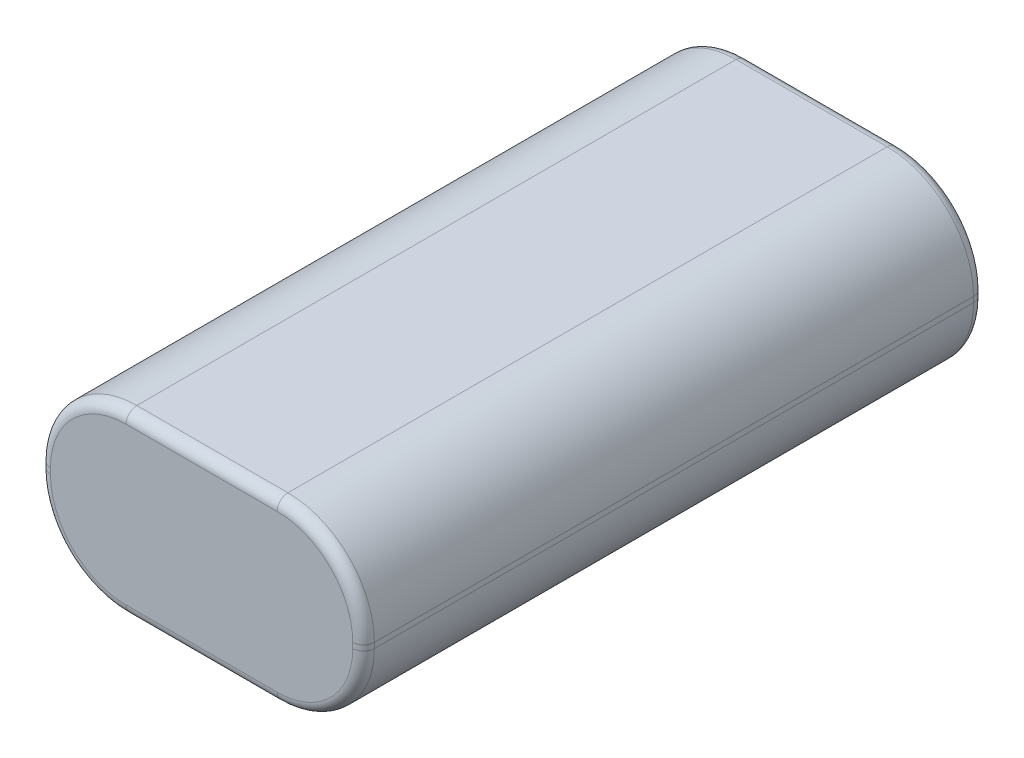
ISO-10303-21;
HEADER;
FILE_DESCRIPTION(('STEP AP214'),'2;1');
FILE_NAME('part.step','',(''),(''),'','','');
FILE_SCHEMA(('AUTOMOTIVE_DESIGN { 1 0 10303 214 1 1 1 1 }'));
ENDSEC;
DATA;
#1=APPLICATION_CONTEXT('core data for automotive mechanical design processes');
#2=APPLICATION_PROTOCOL_DEFINITION('international standard','automotive_design',2000,#1);
#3=PRODUCT_CONTEXT('',#1,'mechanical');
#4=PRODUCT('Part','Part','',(#3));
#5=PRODUCT_RELATED_PRODUCT_CATEGORY('part','',(#4));
#6=PRODUCT_DEFINITION_FORMATION('','',#4);
#7=PRODUCT_DEFINITION_CONTEXT('part definition',#1,'design');
#8=PRODUCT_DEFINITION('design','',#6,#7);
#9=PRODUCT_DEFINITION_SHAPE('','',#8);
#10=(LENGTH_UNIT() NAMED_UNIT(*) SI_UNIT(.MILLI.,.METRE.));
#11=(NAMED_UNIT(*) PLANE_ANGLE_UNIT() SI_UNIT($,.RADIAN.));
#12=(NAMED_UNIT(*) SI_UNIT($,.STERADIAN.) SOLID_ANGLE_UNIT());
#13=UNCERTAINTY_MEASURE_WITH_UNIT(LENGTH_MEASURE(1.E-05),#10,'distance_accuracy_value','');
#14=(GEOMETRIC_REPRESENTATION_CONTEXT(3) GLOBAL_UNCERTAINTY_ASSIGNED_CONTEXT((#13)) GLOBAL_UNIT_ASSIGNED_CONTEXT((#10,
#11,#12)) REPRESENTATION_CONTEXT('',''));
#15=CARTESIAN_POINT('',(0.,0.,0.));
#16=DIRECTION('',(0.,0.,1.));
#17=DIRECTION('',(1.,0.,0.));
#18=AXIS2_PLACEMENT_3D('',#15,#16,#17);
#19=CARTESIAN_POINT('',(8.,8.,57.5));
#20=DIRECTION('',(0.,0.,-1.));
#21=DIRECTION('',(-1.,0.,0.));
#22=AXIS2_PLACEMENT_3D('',#19,#20,#21);
#23=CYLINDRICAL_SURFACE('',#22,8.);
#24=DIRECTION('',(0.,0.,-1.));
#25=VECTOR('',#24,1.);
#26=CARTESIAN_POINT('',(0.,8.00000000000006,57.5));
#27=LINE('',#26,#25);
#28=CARTESIAN_POINT('',(0.,8.00000000000006,56.5));
#29=VERTEX_POINT('',#28);
#30=CARTESIAN_POINT('',(0.,8.00000000000006,1.));
#31=VERTEX_POINT('',#30);
#32=EDGE_CURVE('E347',#29,#31,#27,.T.);
#33=ORIENTED_EDGE('',*,*,#32,.T.);
#34=CARTESIAN_POINT('',(8.,8.,1.));
#35=DIRECTION('',(0.,0.,1.));
#36=DIRECTION('',(1.,0.,0.));
#37=AXIS2_PLACEMENT_3D('',#34,#35,#36);
#38=CIRCLE('',#37,8.);
#39=CARTESIAN_POINT('',(8.00000000000006,0.,1.));
#40=VERTEX_POINT('',#39);
#41=EDGE_CURVE('E296',#31,#40,#38,.T.);
#42=ORIENTED_EDGE('',*,*,#41,.T.);
#43=DIRECTION('',(0.,0.,-1.));
#44=VECTOR('',#43,1.);
#45=CARTESIAN_POINT('',(8.00000000000006,0.,57.5));
#46=LINE('',#45,#44);
#47=CARTESIAN_POINT('',(8.00000000000006,0.,56.5));
#48=VERTEX_POINT('',#47);
#49=EDGE_CURVE('E210',#48,#40,#46,.T.);
#50=ORIENTED_EDGE('',*,*,#49,.F.);
#51=CARTESIAN_POINT('',(8.,8.,56.5));
#52=DIRECTION('',(0.,0.,1.));
#53=DIRECTION('',(1.,0.,0.));
#54=AXIS2_PLACEMENT_3D('',#51,#52,#53);
#55=CIRCLE('',#54,8.);
#56=EDGE_CURVE('E293',#48,#29,#55,.F.);
#57=ORIENTED_EDGE('',*,*,#56,.T.);
#58=EDGE_LOOP('',(#33,#42,#50,#57));
#59=FACE_BOUND('',#58,.T.);
#60=ADVANCED_FACE('F41',(#59),#23,.T.);
#61=CARTESIAN_POINT('',(8.00000000000006,0.,57.5));
#62=DIRECTION('',(0.,1.,0.));
#63=DIRECTION('',(0.,0.,1.));
#64=AXIS2_PLACEMENT_3D('',#61,#62,#63);
#65=PLANE('',#64);
#66=ORIENTED_EDGE('',*,*,#49,.T.);
#67=DIRECTION('',(1.,0.,0.));
#68=VECTOR('',#67,1.);
#69=CARTESIAN_POINT('',(8.00000000000006,0.,1.));
#70=LINE('',#69,#68);
#71=CARTESIAN_POINT('',(21.9999999999999,0.,1.));
#72=VERTEX_POINT('',#71);
#73=EDGE_CURVE('E208',#40,#72,#70,.T.);
#74=ORIENTED_EDGE('',*,*,#73,.T.);
#75=DIRECTION('',(0.,0.,-1.));
#76=VECTOR('',#75,1.);
#77=CARTESIAN_POINT('',(21.9999999999999,0.,57.5));
#78=LINE('',#77,#76);
#79=CARTESIAN_POINT('',(21.9999999999999,0.,56.5));
#80=VERTEX_POINT('',#79);
#81=EDGE_CURVE('E189',#80,#72,#78,.T.);
#82=ORIENTED_EDGE('',*,*,#81,.F.);
#83=DIRECTION('',(1.,0.,0.));
#84=VECTOR('',#83,1.);
#85=CARTESIAN_POINT('',(8.00000000000006,0.,56.5));
#86=LINE('',#85,#84);
#87=EDGE_CURVE('E205',#80,#48,#86,.F.);
#88=ORIENTED_EDGE('',*,*,#87,.T.);
#89=EDGE_LOOP('',(#66,#74,#82,#88));
#90=FACE_BOUND('',#89,.T.);
#91=ADVANCED_FACE('F203',(#90),#65,.F.);
#92=CARTESIAN_POINT('',(22.,8.,57.5));
#93=DIRECTION('',(0.,0.,-1.));
#94=DIRECTION('',(-1.,0.,0.));
#95=AXIS2_PLACEMENT_3D('',#92,#93,#94);
#96=CYLINDRICAL_SURFACE('',#95,8.);
#97=ORIENTED_EDGE('',*,*,#81,.T.);
#98=CARTESIAN_POINT('',(22.,8.,1.));
#99=DIRECTION('',(0.,0.,1.));
#100=DIRECTION('',(1.,0.,0.));
#101=AXIS2_PLACEMENT_3D('',#98,#99,#100);
#102=CIRCLE('',#101,8.);
#103=CARTESIAN_POINT('',(30.,8.00000000000006,1.));
#104=VERTEX_POINT('',#103);
#105=EDGE_CURVE('E197',#72,#104,#102,.T.);
#106=ORIENTED_EDGE('',*,*,#105,.T.);
#107=DIRECTION('',(0.,0.,-1.));
#108=VECTOR('',#107,1.);
#109=CARTESIAN_POINT('',(30.,8.00000000000006,57.5));
#110=LINE('',#109,#108);
#111=CARTESIAN_POINT('',(30.,8.00000000000006,56.5));
#112=VERTEX_POINT('',#111);
#113=EDGE_CURVE('E191',#112,#104,#110,.T.);
#114=ORIENTED_EDGE('',*,*,#113,.F.);
#115=CARTESIAN_POINT('',(22.,8.,56.5));
#116=DIRECTION('',(0.,0.,1.));
#117=DIRECTION('',(1.,0.,0.));
#118=AXIS2_PLACEMENT_3D('',#115,#116,#117);
#119=CIRCLE('',#118,8.);
#120=EDGE_CURVE('E186',#112,#80,#119,.F.);
#121=ORIENTED_EDGE('',*,*,#120,.T.);
#122=EDGE_LOOP('',(#97,#106,#114,#121));
#123=FACE_BOUND('',#122,.T.);
#124=ADVANCED_FACE('F188',(#123),#96,.T.);
#125=CARTESIAN_POINT('',(30.,8.00000000000006,57.5));
#126=DIRECTION('',(-1.,0.,0.));
#127=DIRECTION('',(0.,0.,1.));
#128=AXIS2_PLACEMENT_3D('',#125,#126,#127);
#129=PLANE('',#128);
#130=ORIENTED_EDGE('',*,*,#113,.T.);
#131=DIRECTION('',(0.,1.,0.));
#132=VECTOR('',#131,1.);
#133=CARTESIAN_POINT('',(30.,8.00000000000006,1.));
#134=LINE('',#133,#132);
#135=CARTESIAN_POINT('',(30.,8.49999999999994,1.));
#136=VERTEX_POINT('',#135);
#137=EDGE_CURVE('E265',#104,#136,#134,.T.);
#138=ORIENTED_EDGE('',*,*,#137,.T.);
#139=DIRECTION('',(0.,0.,-1.));
#140=VECTOR('',#139,1.);
#141=CARTESIAN_POINT('',(30.,8.49999999999994,57.5));
#142=LINE('',#141,#140);
#143=CARTESIAN_POINT('',(30.,8.49999999999994,56.5));
#144=VERTEX_POINT('',#143);
#145=EDGE_CURVE('E377',#144,#136,#142,.T.);
#146=ORIENTED_EDGE('',*,*,#145,.F.);
#147=DIRECTION('',(0.,1.,0.));
#148=VECTOR('',#147,1.);
#149=CARTESIAN_POINT('',(30.,8.00000000000006,56.5));
#150=LINE('',#149,#148);
#151=EDGE_CURVE('E262',#144,#112,#150,.F.);
#152=ORIENTED_EDGE('',*,*,#151,.T.);
#153=EDGE_LOOP('',(#130,#138,#146,#152));
#154=FACE_BOUND('',#153,.T.);
#155=ADVANCED_FACE('F374',(#154),#129,.F.);
#156=CARTESIAN_POINT('',(22.,8.5,57.5));
#157=DIRECTION('',(0.,0.,-1.));
#158=DIRECTION('',(-1.,0.,0.));
#159=AXIS2_PLACEMENT_3D('',#156,#157,#158);
#160=CYLINDRICAL_SURFACE('',#159,8.);
#161=ORIENTED_EDGE('',*,*,#145,.T.);
#162=CARTESIAN_POINT('',(22.,8.5,1.));
#163=DIRECTION('',(0.,0.,1.));
#164=DIRECTION('',(1.,0.,0.));
#165=AXIS2_PLACEMENT_3D('',#162,#163,#164);
#166=CIRCLE('',#165,8.);
#167=CARTESIAN_POINT('',(21.9999999999999,16.5,1.));
#168=VERTEX_POINT('',#167);
#169=EDGE_CURVE('E271',#136,#168,#166,.T.);
#170=ORIENTED_EDGE('',*,*,#169,.T.);
#171=DIRECTION('',(0.,0.,-1.));
#172=VECTOR('',#171,1.);
#173=CARTESIAN_POINT('',(21.9999999999999,16.5,57.5));
#174=LINE('',#173,#172);
#175=CARTESIAN_POINT('',(21.9999999999999,16.5,56.5));
#176=VERTEX_POINT('',#175);
#177=EDGE_CURVE('E381',#176,#168,#174,.T.);
#178=ORIENTED_EDGE('',*,*,#177,.F.);
#179=CARTESIAN_POINT('',(22.,8.5,56.5));
#180=DIRECTION('',(0.,0.,1.));
#181=DIRECTION('',(1.,0.,0.));
#182=AXIS2_PLACEMENT_3D('',#179,#180,#181);
#183=CIRCLE('',#182,8.);
#184=EDGE_CURVE('E268',#176,#144,#183,.F.);
#185=ORIENTED_EDGE('',*,*,#184,.T.);
#186=EDGE_LOOP('',(#161,#170,#178,#185));
#187=FACE_BOUND('',#186,.T.);
#188=ADVANCED_FACE('F431',(#187),#160,.T.);
#189=CARTESIAN_POINT('',(8.00000000000006,16.5,57.5));
#190=DIRECTION('',(0.,-1.,0.));
#191=DIRECTION('',(0.,0.,-1.));
#192=AXIS2_PLACEMENT_3D('',#189,#190,#191);
#193=PLANE('',#192);
#194=ORIENTED_EDGE('',*,*,#177,.T.);
#195=DIRECTION('',(-1.,0.,0.));
#196=VECTOR('',#195,1.);
#197=CARTESIAN_POINT('',(8.00000000000006,16.5,1.));
#198=LINE('',#197,#196);
#199=CARTESIAN_POINT('',(8.00000000000006,16.5,1.));
#200=VERTEX_POINT('',#199);
#201=EDGE_CURVE('E277',#168,#200,#198,.T.);
#202=ORIENTED_EDGE('',*,*,#201,.T.);
#203=DIRECTION('',(0.,0.,-1.));
#204=VECTOR('',#203,1.);
#205=CARTESIAN_POINT('',(8.00000000000006,16.5,57.5));
#206=LINE('',#205,#204);
#207=CARTESIAN_POINT('',(8.00000000000006,16.5,56.5));
#208=VERTEX_POINT('',#207);
#209=EDGE_CURVE('E387',#208,#200,#206,.T.);
#210=ORIENTED_EDGE('',*,*,#209,.F.);
#211=DIRECTION('',(-1.,0.,0.));
#212=VECTOR('',#211,1.);
#213=CARTESIAN_POINT('',(21.9999999999999,16.5,56.5));
#214=LINE('',#213,#212);
#215=EDGE_CURVE('E274',#208,#176,#214,.F.);
#216=ORIENTED_EDGE('',*,*,#215,.T.);
#217=EDGE_LOOP('',(#194,#202,#210,#216));
#218=FACE_BOUND('',#217,.T.);
#219=ADVANCED_FACE('F434',(#218),#193,.F.);
#220=CARTESIAN_POINT('',(8.,8.5,57.5));
#221=DIRECTION('',(0.,0.,-1.));
#222=DIRECTION('',(-1.,0.,0.));
#223=AXIS2_PLACEMENT_3D('',#220,#221,#222);
#224=CYLINDRICAL_SURFACE('',#223,8.);
#225=ORIENTED_EDGE('',*,*,#209,.T.);
#226=CARTESIAN_POINT('',(8.,8.5,1.));
#227=DIRECTION('',(0.,0.,1.));
#228=DIRECTION('',(1.,0.,0.));
#229=AXIS2_PLACEMENT_3D('',#226,#227,#228);
#230=CIRCLE('',#229,8.);
#231=CARTESIAN_POINT('',(0.,8.49999999999994,1.));
#232=VERTEX_POINT('',#231);
#233=EDGE_CURVE('E283',#200,#232,#230,.T.);
#234=ORIENTED_EDGE('',*,*,#233,.T.);
#235=DIRECTION('',(0.,0.,-1.));
#236=VECTOR('',#235,1.);
#237=CARTESIAN_POINT('',(0.,8.49999999999994,57.5));
#238=LINE('',#237,#236);
#239=CARTESIAN_POINT('',(0.,8.49999999999994,56.5));
#240=VERTEX_POINT('',#239);
#241=EDGE_CURVE('E393',#240,#232,#238,.T.);
#242=ORIENTED_EDGE('',*,*,#241,.F.);
#243=CARTESIAN_POINT('',(8.,8.5,56.5));
#244=DIRECTION('',(0.,0.,1.));
#245=DIRECTION('',(1.,0.,0.));
#246=AXIS2_PLACEMENT_3D('',#243,#244,#245);
#247=CIRCLE('',#246,8.);
#248=EDGE_CURVE('E280',#240,#208,#247,.F.);
#249=ORIENTED_EDGE('',*,*,#248,.T.);
#250=EDGE_LOOP('',(#225,#234,#242,#249));
#251=FACE_BOUND('',#250,.T.);
#252=ADVANCED_FACE('F448',(#251),#224,.T.);
#253=CARTESIAN_POINT('',(0.,8.00000000000006,57.5));
#254=DIRECTION('',(1.,0.,0.));
#255=DIRECTION('',(0.,0.,-1.));
#256=AXIS2_PLACEMENT_3D('',#253,#254,#255);
#257=PLANE('',#256);
#258=ORIENTED_EDGE('',*,*,#241,.T.);
#259=DIRECTION('',(0.,-1.,0.));
#260=VECTOR('',#259,1.);
#261=CARTESIAN_POINT('',(0.,8.00000000000006,1.));
#262=LINE('',#261,#260);
#263=EDGE_CURVE('E290',#232,#31,#262,.T.);
#264=ORIENTED_EDGE('',*,*,#263,.T.);
#265=ORIENTED_EDGE('',*,*,#32,.F.);
#266=DIRECTION('',(0.,-1.,0.));
#267=VECTOR('',#266,1.);
#268=CARTESIAN_POINT('',(0.,8.49999999999994,56.5));
#269=LINE('',#268,#267);
#270=EDGE_CURVE('E286',#29,#240,#269,.F.);
#271=ORIENTED_EDGE('',*,*,#270,.T.);
#272=EDGE_LOOP('',(#258,#264,#265,#271));
#273=FACE_BOUND('',#272,.T.);
#274=ADVANCED_FACE('F449',(#273),#257,.F.);
#275=CARTESIAN_POINT('',(8.,8.,57.5));
#276=DIRECTION('',(0.,0.,1.));
#277=DIRECTION('',(1.,0.,0.));
#278=AXIS2_PLACEMENT_3D('',#275,#276,#277);
#279=PLANE('',#278);
#280=CARTESIAN_POINT('',(8.,8.5,57.5));
#281=DIRECTION('',(0.,0.,1.));
#282=DIRECTION('',(1.,0.,0.));
#283=AXIS2_PLACEMENT_3D('',#280,#281,#282);
#284=CIRCLE('',#283,7.);
#285=CARTESIAN_POINT('',(8.00000000000005,15.5,57.5));
#286=VERTEX_POINT('',#285);
#287=CARTESIAN_POINT('',(1.,8.49999999999994,57.5));
#288=VERTEX_POINT('',#287);
#289=EDGE_CURVE('E51',#286,#288,#284,.T.);
#290=ORIENTED_EDGE('',*,*,#289,.T.);
#291=DIRECTION('',(0.,-1.,0.));
#292=VECTOR('',#291,1.);
#293=CARTESIAN_POINT('',(1.,8.00000000000006,57.5));
#294=LINE('',#293,#292);
#295=CARTESIAN_POINT('',(1.,8.00000000000006,57.5));
#296=VERTEX_POINT('',#295);
#297=EDGE_CURVE('E11',#288,#296,#294,.T.);
#298=ORIENTED_EDGE('',*,*,#297,.T.);
#299=CARTESIAN_POINT('',(8.,8.,57.5));
#300=DIRECTION('',(0.,0.,1.));
#301=DIRECTION('',(1.,0.,0.));
#302=AXIS2_PLACEMENT_3D('',#299,#300,#301);
#303=CIRCLE('',#302,7.);
#304=CARTESIAN_POINT('',(8.00000000000006,1.,57.5));
#305=VERTEX_POINT('',#304);
#306=EDGE_CURVE('E299',#296,#305,#303,.T.);
#307=ORIENTED_EDGE('',*,*,#306,.T.);
#308=DIRECTION('',(1.,0.,0.));
#309=VECTOR('',#308,1.);
#310=CARTESIAN_POINT('',(21.9999999999999,1.,57.5));
#311=LINE('',#310,#309);
#312=CARTESIAN_POINT('',(21.9999999999999,1.,57.5));
#313=VERTEX_POINT('',#312);
#314=EDGE_CURVE('E302',#305,#313,#311,.T.);
#315=ORIENTED_EDGE('',*,*,#314,.T.);
#316=CARTESIAN_POINT('',(22.,8.,57.5));
#317=DIRECTION('',(0.,0.,1.));
#318=DIRECTION('',(1.,0.,0.));
#319=AXIS2_PLACEMENT_3D('',#316,#317,#318);
#320=CIRCLE('',#319,7.);
#321=CARTESIAN_POINT('',(29.,8.00000000000006,57.5));
#322=VERTEX_POINT('',#321);
#323=EDGE_CURVE('E216',#313,#322,#320,.T.);
#324=ORIENTED_EDGE('',*,*,#323,.T.);
#325=DIRECTION('',(0.,1.,0.));
#326=VECTOR('',#325,1.);
#327=CARTESIAN_POINT('',(29.,8.49999999999994,57.5));
#328=LINE('',#327,#326);
#329=CARTESIAN_POINT('',(29.,8.49999999999995,57.5));
#330=VERTEX_POINT('',#329);
#331=EDGE_CURVE('E307',#322,#330,#328,.T.);
#332=ORIENTED_EDGE('',*,*,#331,.T.);
#333=CARTESIAN_POINT('',(22.,8.5,57.5));
#334=DIRECTION('',(0.,0.,1.));
#335=DIRECTION('',(1.,0.,0.));
#336=AXIS2_PLACEMENT_3D('',#333,#334,#335);
#337=CIRCLE('',#336,7.);
#338=CARTESIAN_POINT('',(21.9999999999999,15.5,57.5));
#339=VERTEX_POINT('',#338);
#340=EDGE_CURVE('E310',#330,#339,#337,.T.);
#341=ORIENTED_EDGE('',*,*,#340,.T.);
#342=DIRECTION('',(-1.,0.,0.));
#343=VECTOR('',#342,1.);
#344=CARTESIAN_POINT('',(8.00000000000006,15.5,57.5));
#345=LINE('',#344,#343);
#346=EDGE_CURVE('E67',#339,#286,#345,.T.);
#347=ORIENTED_EDGE('',*,*,#346,.T.);
#348=EDGE_LOOP('',(#290,#298,#307,#315,#324,#332,#341,#347));
#349=FACE_BOUND('',#348,.T.);
#350=ADVANCED_FACE('F458',(#349),#279,.T.);
#351=CARTESIAN_POINT('',(8.,8.,0.));
#352=DIRECTION('',(0.,0.,1.));
#353=DIRECTION('',(1.,0.,0.));
#354=AXIS2_PLACEMENT_3D('',#351,#352,#353);
#355=PLANE('',#354);
#356=CARTESIAN_POINT('',(22.,8.,0.));
#357=DIRECTION('',(0.,0.,1.));
#358=DIRECTION('',(1.,0.,0.));
#359=AXIS2_PLACEMENT_3D('',#356,#357,#358);
#360=CIRCLE('',#359,7.);
#361=CARTESIAN_POINT('',(29.,8.00000000000005,0.));
#362=VERTEX_POINT('',#361);
#363=CARTESIAN_POINT('',(21.9999999999999,1.,0.));
#364=VERTEX_POINT('',#363);
#365=EDGE_CURVE('E254',#362,#364,#360,.F.);
#366=ORIENTED_EDGE('',*,*,#365,.T.);
#367=DIRECTION('',(1.,0.,0.));
#368=VECTOR('',#367,1.);
#369=CARTESIAN_POINT('',(8.,1.,0.));
#370=LINE('',#369,#368);
#371=CARTESIAN_POINT('',(8.00000000000006,1.,0.));
#372=VERTEX_POINT('',#371);
#373=EDGE_CURVE('E198',#364,#372,#370,.F.);
#374=ORIENTED_EDGE('',*,*,#373,.T.);
#375=CARTESIAN_POINT('',(8.,8.,0.));
#376=DIRECTION('',(0.,0.,1.));
#377=DIRECTION('',(1.,0.,0.));
#378=AXIS2_PLACEMENT_3D('',#375,#376,#377);
#379=CIRCLE('',#378,7.);
#380=CARTESIAN_POINT('',(1.,8.00000000000006,0.));
#381=VERTEX_POINT('',#380);
#382=EDGE_CURVE('E233',#372,#381,#379,.F.);
#383=ORIENTED_EDGE('',*,*,#382,.T.);
#384=DIRECTION('',(0.,-1.,0.));
#385=VECTOR('',#384,1.);
#386=CARTESIAN_POINT('',(1.,8.,0.));
#387=LINE('',#386,#385);
#388=CARTESIAN_POINT('',(1.,8.49999999999995,0.));
#389=VERTEX_POINT('',#388);
#390=EDGE_CURVE('E239',#381,#389,#387,.F.);
#391=ORIENTED_EDGE('',*,*,#390,.T.);
#392=CARTESIAN_POINT('',(8.,8.5,0.));
#393=DIRECTION('',(0.,0.,1.));
#394=DIRECTION('',(1.,0.,0.));
#395=AXIS2_PLACEMENT_3D('',#392,#393,#394);
#396=CIRCLE('',#395,7.);
#397=CARTESIAN_POINT('',(8.00000000000006,15.5,0.));
#398=VERTEX_POINT('',#397);
#399=EDGE_CURVE('E242',#389,#398,#396,.F.);
#400=ORIENTED_EDGE('',*,*,#399,.T.);
#401=DIRECTION('',(-1.,0.,0.));
#402=VECTOR('',#401,1.);
#403=CARTESIAN_POINT('',(8.,15.5,0.));
#404=LINE('',#403,#402);
#405=CARTESIAN_POINT('',(22.,15.5,0.));
#406=VERTEX_POINT('',#405);
#407=EDGE_CURVE('E245',#398,#406,#404,.F.);
#408=ORIENTED_EDGE('',*,*,#407,.T.);
#409=CARTESIAN_POINT('',(22.,8.5,0.));
#410=DIRECTION('',(0.,0.,1.));
#411=DIRECTION('',(1.,0.,0.));
#412=AXIS2_PLACEMENT_3D('',#409,#410,#411);
#413=CIRCLE('',#412,7.);
#414=CARTESIAN_POINT('',(29.,8.49999999999994,0.));
#415=VERTEX_POINT('',#414);
#416=EDGE_CURVE('E248',#406,#415,#413,.F.);
#417=ORIENTED_EDGE('',*,*,#416,.T.);
#418=DIRECTION('',(0.,1.,0.));
#419=VECTOR('',#418,1.);
#420=CARTESIAN_POINT('',(29.,8.,0.));
#421=LINE('',#420,#419);
#422=EDGE_CURVE('E251',#415,#362,#421,.F.);
#423=ORIENTED_EDGE('',*,*,#422,.T.);
#424=EDGE_LOOP('',(#366,#374,#383,#391,#400,#408,#417,#423));
#425=FACE_BOUND('',#424,.T.);
#426=ADVANCED_FACE('F460',(#425),#355,.F.);
#427=CARTESIAN_POINT('',(8.00000000000006,15.5,1.));
#428=DIRECTION('',(-1.,0.,0.));
#429=DIRECTION('',(0.,0.,1.));
#430=AXIS2_PLACEMENT_3D('',#427,#428,#429);
#431=CYLINDRICAL_SURFACE('',#430,1.);
#432=CARTESIAN_POINT('',(22.,15.5,1.));
#433=DIRECTION('',(1.,0.,0.));
#434=DIRECTION('',(0.,1.,0.));
#435=AXIS2_PLACEMENT_3D('',#432,#433,#434);
#436=CIRCLE('',#435,1.);
#437=EDGE_CURVE('E339',#406,#168,#436,.T.);
#438=ORIENTED_EDGE('',*,*,#437,.F.);
#439=ORIENTED_EDGE('',*,*,#407,.F.);
#440=CARTESIAN_POINT('',(8.00000000000006,15.5,1.));
#441=DIRECTION('',(-1.,0.,0.));
#442=DIRECTION('',(0.,0.,1.));
#443=AXIS2_PLACEMENT_3D('',#440,#441,#442);
#444=CIRCLE('',#443,1.);
#445=EDGE_CURVE('E343',#200,#398,#444,.T.);
#446=ORIENTED_EDGE('',*,*,#445,.F.);
#447=ORIENTED_EDGE('',*,*,#201,.F.);
#448=EDGE_LOOP('',(#438,#439,#446,#447));
#449=FACE_BOUND('',#448,.T.);
#450=ADVANCED_FACE('F439',(#449),#431,.T.);
#451=CARTESIAN_POINT('',(8.,8.5,1.));
#452=DIRECTION('',(0.,0.,1.));
#453=DIRECTION('',(1.,0.,0.));
#454=AXIS2_PLACEMENT_3D('',#451,#452,#453);
#455=TOROIDAL_SURFACE('',#454,7.,1.);
#456=ORIENTED_EDGE('',*,*,#445,.T.);
#457=ORIENTED_EDGE('',*,*,#399,.F.);
#458=CARTESIAN_POINT('',(1.,8.49999999999995,1.));
#459=DIRECTION('',(0.,-1.,0.));
#460=DIRECTION('',(1.,0.,0.));
#461=AXIS2_PLACEMENT_3D('',#458,#459,#460);
#462=CIRCLE('',#461,1.);
#463=EDGE_CURVE('E335',#232,#389,#462,.T.);
#464=ORIENTED_EDGE('',*,*,#463,.F.);
#465=ORIENTED_EDGE('',*,*,#233,.F.);
#466=EDGE_LOOP('',(#456,#457,#464,#465));
#467=FACE_BOUND('',#466,.T.);
#468=ADVANCED_FACE('F445',(#467),#455,.T.);
#469=CARTESIAN_POINT('',(22.,8.5,1.));
#470=DIRECTION('',(0.,0.,1.));
#471=DIRECTION('',(1.,0.,0.));
#472=AXIS2_PLACEMENT_3D('',#469,#470,#471);
#473=TOROIDAL_SURFACE('',#472,7.,1.);
#474=ORIENTED_EDGE('',*,*,#437,.T.);
#475=ORIENTED_EDGE('',*,*,#169,.F.);
#476=CARTESIAN_POINT('',(29.,8.49999999999994,1.));
#477=DIRECTION('',(0.,-1.,0.));
#478=DIRECTION('',(0.,0.,-1.));
#479=AXIS2_PLACEMENT_3D('',#476,#477,#478);
#480=CIRCLE('',#479,1.);
#481=EDGE_CURVE('E331',#415,#136,#480,.T.);
#482=ORIENTED_EDGE('',*,*,#481,.F.);
#483=ORIENTED_EDGE('',*,*,#416,.F.);
#484=EDGE_LOOP('',(#474,#475,#482,#483));
#485=FACE_BOUND('',#484,.T.);
#486=ADVANCED_FACE('F428',(#485),#473,.T.);
#487=CARTESIAN_POINT('',(1.,8.00000000000006,1.));
#488=DIRECTION('',(0.,-1.,0.));
#489=DIRECTION('',(0.,0.,-1.));
#490=AXIS2_PLACEMENT_3D('',#487,#488,#489);
#491=CYLINDRICAL_SURFACE('',#490,1.);
#492=ORIENTED_EDGE('',*,*,#463,.T.);
#493=ORIENTED_EDGE('',*,*,#390,.F.);
#494=CARTESIAN_POINT('',(1.,8.00000000000006,1.));
#495=DIRECTION('',(0.,-1.,0.));
#496=DIRECTION('',(0.,0.,-1.));
#497=AXIS2_PLACEMENT_3D('',#494,#495,#496);
#498=CIRCLE('',#497,1.);
#499=EDGE_CURVE('E327',#31,#381,#498,.T.);
#500=ORIENTED_EDGE('',*,*,#499,.F.);
#501=ORIENTED_EDGE('',*,*,#263,.F.);
#502=EDGE_LOOP('',(#492,#493,#500,#501));
#503=FACE_BOUND('',#502,.T.);
#504=ADVANCED_FACE('F408',(#503),#491,.T.);
#505=CARTESIAN_POINT('',(29.,8.00000000000006,1.));
#506=DIRECTION('',(0.,1.,0.));
#507=DIRECTION('',(0.,0.,1.));
#508=AXIS2_PLACEMENT_3D('',#505,#506,#507);
#509=CYLINDRICAL_SURFACE('',#508,1.);
#510=ORIENTED_EDGE('',*,*,#481,.T.);
#511=ORIENTED_EDGE('',*,*,#137,.F.);
#512=CARTESIAN_POINT('',(29.,8.00000000000005,1.));
#513=DIRECTION('',(0.,-1.,0.));
#514=DIRECTION('',(1.,0.,0.));
#515=AXIS2_PLACEMENT_3D('',#512,#513,#514);
#516=CIRCLE('',#515,1.);
#517=EDGE_CURVE('E323',#362,#104,#516,.T.);
#518=ORIENTED_EDGE('',*,*,#517,.F.);
#519=ORIENTED_EDGE('',*,*,#422,.F.);
#520=EDGE_LOOP('',(#510,#511,#518,#519));
#521=FACE_BOUND('',#520,.T.);
#522=ADVANCED_FACE('F424',(#521),#509,.T.);
#523=CARTESIAN_POINT('',(8.,8.,1.));
#524=DIRECTION('',(0.,0.,1.));
#525=DIRECTION('',(1.,0.,0.));
#526=AXIS2_PLACEMENT_3D('',#523,#524,#525);
#527=TOROIDAL_SURFACE('',#526,7.,1.);
#528=ORIENTED_EDGE('',*,*,#499,.T.);
#529=ORIENTED_EDGE('',*,*,#382,.F.);
#530=CARTESIAN_POINT('',(8.00000000000005,1.,1.));
#531=DIRECTION('',(1.,0.,0.));
#532=DIRECTION('',(0.,1.,0.));
#533=AXIS2_PLACEMENT_3D('',#530,#531,#532);
#534=CIRCLE('',#533,1.);
#535=EDGE_CURVE('E320',#40,#372,#534,.T.);
#536=ORIENTED_EDGE('',*,*,#535,.F.);
#537=ORIENTED_EDGE('',*,*,#41,.F.);
#538=EDGE_LOOP('',(#528,#529,#536,#537));
#539=FACE_BOUND('',#538,.T.);
#540=ADVANCED_FACE('F412',(#539),#527,.T.);
#541=CARTESIAN_POINT('',(22.,8.,1.));
#542=DIRECTION('',(0.,0.,1.));
#543=DIRECTION('',(1.,0.,0.));
#544=AXIS2_PLACEMENT_3D('',#541,#542,#543);
#545=TOROIDAL_SURFACE('',#544,7.,1.);
#546=ORIENTED_EDGE('',*,*,#517,.T.);
#547=ORIENTED_EDGE('',*,*,#105,.F.);
#548=CARTESIAN_POINT('',(21.9999999999999,1.,1.));
#549=DIRECTION('',(-1.,0.,0.));
#550=DIRECTION('',(0.,0.,1.));
#551=AXIS2_PLACEMENT_3D('',#548,#549,#550);
#552=CIRCLE('',#551,1.);
#553=EDGE_CURVE('E317',#364,#72,#552,.T.);
#554=ORIENTED_EDGE('',*,*,#553,.F.);
#555=ORIENTED_EDGE('',*,*,#365,.F.);
#556=EDGE_LOOP('',(#546,#547,#554,#555));
#557=FACE_BOUND('',#556,.T.);
#558=ADVANCED_FACE('F420',(#557),#545,.T.);
#559=CARTESIAN_POINT('',(8.00000000000006,1.,1.));
#560=DIRECTION('',(1.,0.,0.));
#561=DIRECTION('',(0.,0.,-1.));
#562=AXIS2_PLACEMENT_3D('',#559,#560,#561);
#563=CYLINDRICAL_SURFACE('',#562,1.);
#564=ORIENTED_EDGE('',*,*,#535,.T.);
#565=ORIENTED_EDGE('',*,*,#373,.F.);
#566=ORIENTED_EDGE('',*,*,#553,.T.);
#567=ORIENTED_EDGE('',*,*,#73,.F.);
#568=EDGE_LOOP('',(#564,#565,#566,#567));
#569=FACE_BOUND('',#568,.T.);
#570=ADVANCED_FACE('F415',(#569),#563,.T.);
#571=CARTESIAN_POINT('',(29.,8.,56.5));
#572=DIRECTION('',(0.,-1.,0.));
#573=DIRECTION('',(0.,0.,-1.));
#574=AXIS2_PLACEMENT_3D('',#571,#572,#573);
#575=CYLINDRICAL_SURFACE('',#574,1.);
#576=CARTESIAN_POINT('',(29.,8.00000000000006,56.5));
#577=DIRECTION('',(0.,-1.,0.));
#578=DIRECTION('',(0.,0.,-1.));
#579=AXIS2_PLACEMENT_3D('',#576,#577,#578);
#580=CIRCLE('',#579,1.);
#581=EDGE_CURVE('E359',#112,#322,#580,.T.);
#582=ORIENTED_EDGE('',*,*,#581,.F.);
#583=ORIENTED_EDGE('',*,*,#151,.F.);
#584=CARTESIAN_POINT('',(29.,8.49999999999995,56.5));
#585=DIRECTION('',(0.,1.,0.));
#586=DIRECTION('',(-1.,0.,0.));
#587=AXIS2_PLACEMENT_3D('',#584,#585,#586);
#588=CIRCLE('',#587,1.);
#589=EDGE_CURVE('E45',#330,#144,#588,.T.);
#590=ORIENTED_EDGE('',*,*,#589,.F.);
#591=ORIENTED_EDGE('',*,*,#331,.F.);
#592=EDGE_LOOP('',(#582,#583,#590,#591));
#593=FACE_BOUND('',#592,.T.);
#594=ADVANCED_FACE('F43',(#593),#575,.T.);
#595=CARTESIAN_POINT('',(22.,8.5,56.5));
#596=DIRECTION('',(0.,0.,1.));
#597=DIRECTION('',(1.,0.,0.));
#598=AXIS2_PLACEMENT_3D('',#595,#596,#597);
#599=TOROIDAL_SURFACE('',#598,7.,1.);
#600=ORIENTED_EDGE('',*,*,#589,.T.);
#601=ORIENTED_EDGE('',*,*,#184,.F.);
#602=CARTESIAN_POINT('',(21.9999999999999,15.5,56.5));
#603=DIRECTION('',(-1.,0.,0.));
#604=DIRECTION('',(0.,0.,1.));
#605=AXIS2_PLACEMENT_3D('',#602,#603,#604);
#606=CIRCLE('',#605,1.);
#607=EDGE_CURVE('E220',#339,#176,#606,.T.);
#608=ORIENTED_EDGE('',*,*,#607,.F.);
#609=ORIENTED_EDGE('',*,*,#340,.F.);
#610=EDGE_LOOP('',(#600,#601,#608,#609));
#611=FACE_BOUND('',#610,.T.);
#612=ADVANCED_FACE('F367',(#611),#599,.T.);
#613=CARTESIAN_POINT('',(22.,8.,56.5));
#614=DIRECTION('',(0.,0.,1.));
#615=DIRECTION('',(1.,0.,0.));
#616=AXIS2_PLACEMENT_3D('',#613,#614,#615);
#617=TOROIDAL_SURFACE('',#616,7.,1.);
#618=ORIENTED_EDGE('',*,*,#581,.T.);
#619=ORIENTED_EDGE('',*,*,#323,.F.);
#620=CARTESIAN_POINT('',(21.9999999999999,1.,56.5));
#621=DIRECTION('',(-1.,0.,0.));
#622=DIRECTION('',(0.,-1.,0.));
#623=AXIS2_PLACEMENT_3D('',#620,#621,#622);
#624=CIRCLE('',#623,1.);
#625=EDGE_CURVE('E214',#80,#313,#624,.T.);
#626=ORIENTED_EDGE('',*,*,#625,.F.);
#627=ORIENTED_EDGE('',*,*,#120,.F.);
#628=EDGE_LOOP('',(#618,#619,#626,#627));
#629=FACE_BOUND('',#628,.T.);
#630=ADVANCED_FACE('F215',(#629),#617,.T.);
#631=CARTESIAN_POINT('',(8.,15.5,56.5));
#632=DIRECTION('',(1.,0.,0.));
#633=DIRECTION('',(0.,0.,-1.));
#634=AXIS2_PLACEMENT_3D('',#631,#632,#633);
#635=CYLINDRICAL_SURFACE('',#634,1.);
#636=ORIENTED_EDGE('',*,*,#607,.T.);
#637=ORIENTED_EDGE('',*,*,#215,.F.);
#638=CARTESIAN_POINT('',(8.00000000000005,15.5,56.5));
#639=DIRECTION('',(-1.,0.,0.));
#640=DIRECTION('',(0.,-1.,0.));
#641=AXIS2_PLACEMENT_3D('',#638,#639,#640);
#642=CIRCLE('',#641,1.);
#643=EDGE_CURVE('E221',#286,#208,#642,.T.);
#644=ORIENTED_EDGE('',*,*,#643,.F.);
#645=ORIENTED_EDGE('',*,*,#346,.F.);
#646=EDGE_LOOP('',(#636,#637,#644,#645));
#647=FACE_BOUND('',#646,.T.);
#648=ADVANCED_FACE('F503',(#647),#635,.T.);
#649=CARTESIAN_POINT('',(8.,1.,56.5));
#650=DIRECTION('',(-1.,0.,0.));
#651=DIRECTION('',(0.,0.,1.));
#652=AXIS2_PLACEMENT_3D('',#649,#650,#651);
#653=CYLINDRICAL_SURFACE('',#652,1.);
#654=ORIENTED_EDGE('',*,*,#625,.T.);
#655=ORIENTED_EDGE('',*,*,#314,.F.);
#656=CARTESIAN_POINT('',(8.00000000000006,1.,56.5));
#657=DIRECTION('',(-1.,0.,0.));
#658=DIRECTION('',(0.,0.,1.));
#659=AXIS2_PLACEMENT_3D('',#656,#657,#658);
#660=CIRCLE('',#659,1.);
#661=EDGE_CURVE('E226',#48,#305,#660,.T.);
#662=ORIENTED_EDGE('',*,*,#661,.F.);
#663=ORIENTED_EDGE('',*,*,#87,.F.);
#664=EDGE_LOOP('',(#654,#655,#662,#663));
#665=FACE_BOUND('',#664,.T.);
#666=ADVANCED_FACE('F224',(#665),#653,.T.);
#667=CARTESIAN_POINT('',(8.,8.5,56.5));
#668=DIRECTION('',(0.,0.,1.));
#669=DIRECTION('',(1.,0.,0.));
#670=AXIS2_PLACEMENT_3D('',#667,#668,#669);
#671=TOROIDAL_SURFACE('',#670,7.,1.);
#672=ORIENTED_EDGE('',*,*,#643,.T.);
#673=ORIENTED_EDGE('',*,*,#248,.F.);
#674=CARTESIAN_POINT('',(1.,8.49999999999994,56.5));
#675=DIRECTION('',(0.,-1.,0.));
#676=DIRECTION('',(0.,0.,-1.));
#677=AXIS2_PLACEMENT_3D('',#674,#675,#676);
#678=CIRCLE('',#677,1.);
#679=EDGE_CURVE('E351',#288,#240,#678,.T.);
#680=ORIENTED_EDGE('',*,*,#679,.F.);
#681=ORIENTED_EDGE('',*,*,#289,.F.);
#682=EDGE_LOOP('',(#672,#673,#680,#681));
#683=FACE_BOUND('',#682,.T.);
#684=ADVANCED_FACE('F497',(#683),#671,.T.);
#685=CARTESIAN_POINT('',(8.,8.,56.5));
#686=DIRECTION('',(0.,0.,1.));
#687=DIRECTION('',(1.,0.,0.));
#688=AXIS2_PLACEMENT_3D('',#685,#686,#687);
#689=TOROIDAL_SURFACE('',#688,7.,1.);
#690=ORIENTED_EDGE('',*,*,#661,.T.);
#691=ORIENTED_EDGE('',*,*,#306,.F.);
#692=CARTESIAN_POINT('',(1.,8.00000000000005,56.5));
#693=DIRECTION('',(0.,1.,0.));
#694=DIRECTION('',(-1.,0.,0.));
#695=AXIS2_PLACEMENT_3D('',#692,#693,#694);
#696=CIRCLE('',#695,1.);
#697=EDGE_CURVE('E348',#29,#296,#696,.T.);
#698=ORIENTED_EDGE('',*,*,#697,.F.);
#699=ORIENTED_EDGE('',*,*,#56,.F.);
#700=EDGE_LOOP('',(#690,#691,#698,#699));
#701=FACE_BOUND('',#700,.T.);
#702=ADVANCED_FACE('F457',(#701),#689,.T.);
#703=CARTESIAN_POINT('',(1.,8.,56.5));
#704=DIRECTION('',(0.,1.,0.));
#705=DIRECTION('',(0.,0.,1.));
#706=AXIS2_PLACEMENT_3D('',#703,#704,#705);
#707=CYLINDRICAL_SURFACE('',#706,1.);
#708=ORIENTED_EDGE('',*,*,#679,.T.);
#709=ORIENTED_EDGE('',*,*,#270,.F.);
#710=ORIENTED_EDGE('',*,*,#697,.T.);
#711=ORIENTED_EDGE('',*,*,#297,.F.);
#712=EDGE_LOOP('',(#708,#709,#710,#711));
#713=FACE_BOUND('',#712,.T.);
#714=ADVANCED_FACE('F452',(#713),#707,.T.);
#715=CLOSED_SHELL('',(#60,#91,#124,#155,#188,#219,#252,#274,#350,#426,#450,#468,#486,#504,#522,
#540,#558,#570,#594,#612,#630,#648,#666,#684,#702,#714));
#716=MANIFOLD_SOLID_BREP('B2',#715);
#717=ADVANCED_BREP_SHAPE_REPRESENTATION('',(#18,#716),#14);
#718=SHAPE_DEFINITION_REPRESENTATION(#9,#717);
ENDSEC;
END-ISO-10303-21;
